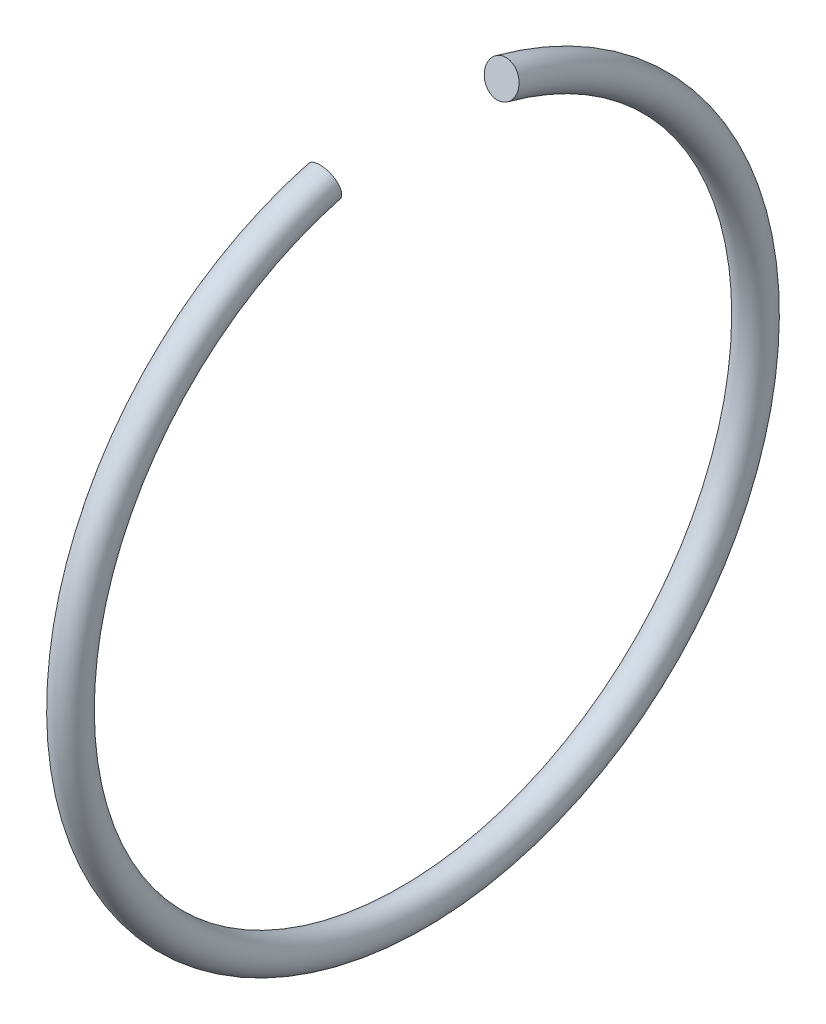
ISO-10303-21;
HEADER;
FILE_DESCRIPTION(('STEP AP214'),'2;1');
FILE_NAME('part.step','',(''),(''),'','','');
FILE_SCHEMA(('AUTOMOTIVE_DESIGN { 1 0 10303 214 1 1 1 1 }'));
ENDSEC;
DATA;
#1=APPLICATION_CONTEXT('core data for automotive mechanical design processes');
#2=APPLICATION_PROTOCOL_DEFINITION('international standard','automotive_design',2000,#1);
#3=PRODUCT_CONTEXT('',#1,'mechanical');
#4=PRODUCT('Part','Part','',(#3));
#5=PRODUCT_RELATED_PRODUCT_CATEGORY('part','',(#4));
#6=PRODUCT_DEFINITION_FORMATION('','',#4);
#7=PRODUCT_DEFINITION_CONTEXT('part definition',#1,'design');
#8=PRODUCT_DEFINITION('design','',#6,#7);
#9=PRODUCT_DEFINITION_SHAPE('','',#8);
#10=(LENGTH_UNIT() NAMED_UNIT(*) SI_UNIT(.MILLI.,.METRE.));
#11=(NAMED_UNIT(*) PLANE_ANGLE_UNIT() SI_UNIT($,.RADIAN.));
#12=(NAMED_UNIT(*) SI_UNIT($,.STERADIAN.) SOLID_ANGLE_UNIT());
#13=UNCERTAINTY_MEASURE_WITH_UNIT(LENGTH_MEASURE(1.E-05),#10,'distance_accuracy_value','');
#14=(GEOMETRIC_REPRESENTATION_CONTEXT(3) GLOBAL_UNCERTAINTY_ASSIGNED_CONTEXT((#13)) GLOBAL_UNIT_ASSIGNED_CONTEXT((#10,
#11,#12)) REPRESENTATION_CONTEXT('',''));
#15=CARTESIAN_POINT('',(0.,0.,0.));
#16=DIRECTION('',(0.,0.,1.));
#17=DIRECTION('',(1.,0.,0.));
#18=AXIS2_PLACEMENT_3D('',#15,#16,#17);
#19=CARTESIAN_POINT('',(-113.45,0.,0.));
#20=DIRECTION('',(1.,0.,0.));
#21=DIRECTION('',(0.,1.,0.));
#22=AXIS2_PLACEMENT_3D('',#19,#20,#21);
#23=TOROIDAL_SURFACE('',#22,32.5,1.60000000000001);
#24=CARTESIAN_POINT('',(-113.45,31.3925893543949,8.41161896583171));
#25=DIRECTION('',(0.,0.258819045102515,-0.96592582628907));
#26=DIRECTION('',(1.,0.,0.));
#27=AXIS2_PLACEMENT_3D('',#24,#25,#26);
#28=CIRCLE('',#27,1.60000000000001);
#29=CARTESIAN_POINT('',(-113.45,32.9380706764574,8.82572943799573));
#30=VERTEX_POINT('',#29);
#31=EDGE_CURVE('E10',#30,#30,#28,.T.);
#32=CARTESIAN_POINT('',(-113.45,31.3925893543948,-8.41161896583175));
#33=DIRECTION('',(0.,-0.258819045102515,-0.96592582628907));
#34=DIRECTION('',(1.,0.,0.));
#35=AXIS2_PLACEMENT_3D('',#32,#33,#34);
#36=CIRCLE('',#35,1.60000000000001);
#37=CARTESIAN_POINT('',(-113.45,32.9380706764574,-8.82572943799578));
#38=VERTEX_POINT('',#37);
#39=EDGE_CURVE('E40',#38,#38,#36,.T.);
#40=CARTESIAN_POINT('',(-113.45,0.,0.));
#41=DIRECTION('',(1.,0.,0.));
#42=DIRECTION('',(0.,1.,0.));
#43=AXIS2_PLACEMENT_3D('',#40,#41,#42);
#44=CIRCLE('',#43,34.1);
#45=EDGE_CURVE('',#30,#38,#44,.T.);
#46=ORIENTED_EDGE('',*,*,#31,.F.);
#47=ORIENTED_EDGE('',*,*,#39,.T.);
#48=ORIENTED_EDGE('',*,*,#45,.T.);
#49=ORIENTED_EDGE('',*,*,#45,.F.);
#50=EDGE_LOOP('',(#46,#48,#47,#49));
#51=FACE_BOUND('',#50,.T.);
#52=ADVANCED_FACE('F34',(#51),#23,.T.);
#53=CARTESIAN_POINT('',(-113.45,31.3925893543949,8.41161896583171));
#54=DIRECTION('',(0.,0.258819045102515,-0.96592582628907));
#55=DIRECTION('',(1.,0.,0.));
#56=AXIS2_PLACEMENT_3D('',#53,#54,#55);
#57=PLANE('',#56);
#58=ORIENTED_EDGE('',*,*,#31,.T.);
#59=EDGE_LOOP('',(#58));
#60=FACE_BOUND('',#59,.T.);
#61=ADVANCED_FACE('F49',(#60),#57,.T.);
#62=CARTESIAN_POINT('',(-113.45,31.3925893543948,-8.41161896583175));
#63=DIRECTION('',(0.,-0.258819045102515,-0.96592582628907));
#64=DIRECTION('',(1.,0.,0.));
#65=AXIS2_PLACEMENT_3D('',#62,#63,#64);
#66=PLANE('',#65);
#67=ORIENTED_EDGE('',*,*,#39,.F.);
#68=EDGE_LOOP('',(#67));
#69=FACE_BOUND('',#68,.T.);
#70=ADVANCED_FACE('F47',(#69),#66,.F.);
#71=CLOSED_SHELL('',(#52,#61,#70));
#72=MANIFOLD_SOLID_BREP('B2',#71);
#73=ADVANCED_BREP_SHAPE_REPRESENTATION('',(#18,#72),#14);
#74=SHAPE_DEFINITION_REPRESENTATION(#9,#73);
ENDSEC;
END-ISO-10303-21;
